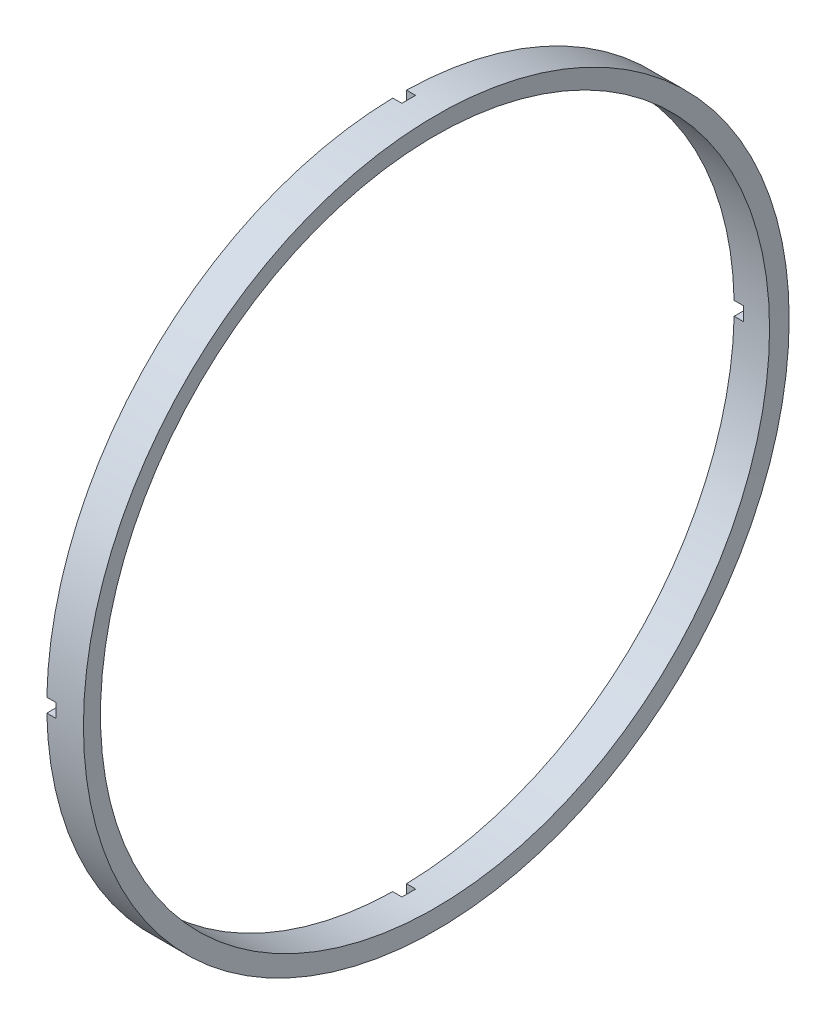
ISO-10303-21;
HEADER;
FILE_DESCRIPTION(('STEP AP214'),'2;1');
FILE_NAME('part.step','',(''),(''),'','','');
FILE_SCHEMA(('AUTOMOTIVE_DESIGN { 1 0 10303 214 1 1 1 1 }'));
ENDSEC;
DATA;
#1=APPLICATION_CONTEXT('core data for automotive mechanical design processes');
#2=APPLICATION_PROTOCOL_DEFINITION('international standard','automotive_design',2000,#1);
#3=PRODUCT_CONTEXT('',#1,'mechanical');
#4=PRODUCT('Part','Part','',(#3));
#5=PRODUCT_RELATED_PRODUCT_CATEGORY('part','',(#4));
#6=PRODUCT_DEFINITION_FORMATION('','',#4);
#7=PRODUCT_DEFINITION_CONTEXT('part definition',#1,'design');
#8=PRODUCT_DEFINITION('design','',#6,#7);
#9=PRODUCT_DEFINITION_SHAPE('','',#8);
#10=(LENGTH_UNIT() NAMED_UNIT(*) SI_UNIT(.MILLI.,.METRE.));
#11=(NAMED_UNIT(*) PLANE_ANGLE_UNIT() SI_UNIT($,.RADIAN.));
#12=(NAMED_UNIT(*) SI_UNIT($,.STERADIAN.) SOLID_ANGLE_UNIT());
#13=UNCERTAINTY_MEASURE_WITH_UNIT(LENGTH_MEASURE(1.E-05),#10,'distance_accuracy_value','');
#14=(GEOMETRIC_REPRESENTATION_CONTEXT(3) GLOBAL_UNCERTAINTY_ASSIGNED_CONTEXT((#13)) GLOBAL_UNIT_ASSIGNED_CONTEXT((#10,
#11,#12)) REPRESENTATION_CONTEXT('',''));
#15=CARTESIAN_POINT('',(0.,0.,0.));
#16=DIRECTION('',(0.,0.,1.));
#17=DIRECTION('',(1.,0.,0.));
#18=AXIS2_PLACEMENT_3D('',#15,#16,#17);
#19=CARTESIAN_POINT('',(0.,0.,0.));
#20=DIRECTION('',(1.00000000000002,0.,0.));
#21=DIRECTION('',(0.,0.,-1.));
#22=AXIS2_PLACEMENT_3D('',#19,#20,#21);
#23=CYLINDRICAL_SURFACE('',#22,38.5);
#24=CARTESIAN_POINT('',(-19.643965459528,0.,0.));
#25=DIRECTION('',(1.00000000000002,0.,0.));
#26=DIRECTION('',(0.,0.,-1.));
#27=AXIS2_PLACEMENT_3D('',#24,#25,#26);
#28=CIRCLE('',#27,38.5);
#29=CARTESIAN_POINT('',(-19.6439654595279,-1.75637288691068E-13,-38.5));
#30=VERTEX_POINT('',#29);
#31=EDGE_CURVE('E312',#30,#30,#28,.T.);
#32=ORIENTED_EDGE('',*,*,#31,.F.);
#33=EDGE_LOOP('',(#32));
#34=FACE_BOUND('',#33,.T.);
#35=CARTESIAN_POINT('',(-23.6439654595282,0.,0.));
#36=DIRECTION('',(1.00000000000002,0.,0.));
#37=DIRECTION('',(0.,0.,-1.));
#38=AXIS2_PLACEMENT_3D('',#35,#36,#37);
#39=CIRCLE('',#38,38.5);
#40=CARTESIAN_POINT('',(-23.6439654595281,0.750000000000042,-38.4926941120001));
#41=VERTEX_POINT('',#40);
#42=CARTESIAN_POINT('',(-23.64396545953,38.4926941120023,-0.750000000000536));
#43=VERTEX_POINT('',#42);
#44=EDGE_CURVE('E277',#41,#43,#39,.T.);
#45=ORIENTED_EDGE('',*,*,#44,.T.);
#46=DIRECTION('',(1.00000000000002,0.,0.));
#47=VECTOR('',#46,1.);
#48=CARTESIAN_POINT('',(2.22044604925031E-13,38.4926941120003,-0.750000000000002));
#49=LINE('',#48,#47);
#50=CARTESIAN_POINT('',(-22.6439654595296,38.4926941120014,-0.750000000000496));
#51=VERTEX_POINT('',#50);
#52=EDGE_CURVE('E321',#43,#51,#49,.T.);
#53=ORIENTED_EDGE('',*,*,#52,.T.);
#54=CARTESIAN_POINT('',(-22.6439654595281,0.,0.));
#55=DIRECTION('',(-1.00000000000002,0.,0.));
#56=DIRECTION('',(0.,0.,1.));
#57=AXIS2_PLACEMENT_3D('',#54,#55,#56);
#58=CIRCLE('',#57,38.5);
#59=CARTESIAN_POINT('',(-22.6439654595307,38.4926941120021,0.749999999999492));
#60=VERTEX_POINT('',#59);
#61=EDGE_CURVE('E326',#51,#60,#58,.F.);
#62=ORIENTED_EDGE('',*,*,#61,.T.);
#63=DIRECTION('',(1.00000000000002,0.,0.));
#64=VECTOR('',#63,1.);
#65=CARTESIAN_POINT('',(0.,38.492694112,0.750000000000013));
#66=LINE('',#65,#64);
#67=CARTESIAN_POINT('',(-23.6439654595306,38.4926941120019,0.749999999999202));
#68=VERTEX_POINT('',#67);
#69=EDGE_CURVE('E316',#68,#60,#66,.T.);
#70=ORIENTED_EDGE('',*,*,#69,.F.);
#71=CARTESIAN_POINT('',(-23.6439654595282,0.750000000000042,38.4926941119999));
#72=VERTEX_POINT('',#71);
#73=EDGE_CURVE('E286',#68,#72,#39,.T.);
#74=ORIENTED_EDGE('',*,*,#73,.T.);
#75=DIRECTION('',(1.00000000000002,0.,0.));
#76=VECTOR('',#75,1.);
#77=CARTESIAN_POINT('',(-1.11022302462516E-13,0.750000000000015,38.4926941119998));
#78=LINE('',#77,#76);
#79=CARTESIAN_POINT('',(-22.6439654595302,0.75000000000057,38.4926941119989));
#80=VERTEX_POINT('',#79);
#81=EDGE_CURVE('E280',#72,#80,#78,.T.);
#82=ORIENTED_EDGE('',*,*,#81,.T.);
#83=CARTESIAN_POINT('',(-22.6439654595296,-0.749999999999612,38.492694111999));
#84=VERTEX_POINT('',#83);
#85=EDGE_CURVE('E324',#80,#84,#58,.F.);
#86=ORIENTED_EDGE('',*,*,#85,.T.);
#87=DIRECTION('',(1.00000000000002,0.,0.));
#88=VECTOR('',#87,1.);
#89=CARTESIAN_POINT('',(1.11022302462516E-13,-0.749999999999973,38.4926941119999));
#90=LINE('',#89,#88);
#91=CARTESIAN_POINT('',(-23.6439654595279,-0.749999999999904,38.4926941119999));
#92=VERTEX_POINT('',#91);
#93=EDGE_CURVE('E333',#92,#84,#90,.T.);
#94=ORIENTED_EDGE('',*,*,#93,.F.);
#95=CARTESIAN_POINT('',(-23.6439654595279,-38.4926941120001,0.74999999999999));
#96=VERTEX_POINT('',#95);
#97=EDGE_CURVE('E292',#92,#96,#39,.T.);
#98=ORIENTED_EDGE('',*,*,#97,.T.);
#99=DIRECTION('',(1.00000000000002,0.,0.));
#100=VECTOR('',#99,1.);
#101=CARTESIAN_POINT('',(5.82867087928207E-13,-38.4926941120002,0.749999999999959));
#102=LINE('',#101,#100);
#103=CARTESIAN_POINT('',(-22.6439654595281,-38.4926941120001,0.749999999999977));
#104=VERTEX_POINT('',#103);
#105=EDGE_CURVE('E327',#104,#96,#102,.F.);
#106=ORIENTED_EDGE('',*,*,#105,.F.);
#107=CARTESIAN_POINT('',(-22.6439654595281,-38.492694112,-0.74999999999999));
#108=VERTEX_POINT('',#107);
#109=EDGE_CURVE('E323',#104,#108,#58,.F.);
#110=ORIENTED_EDGE('',*,*,#109,.T.);
#111=DIRECTION('',(1.00000000000002,0.,0.));
#112=VECTOR('',#111,1.);
#113=CARTESIAN_POINT('',(0.,-38.492694112,-0.750000000000001));
#114=LINE('',#113,#112);
#115=CARTESIAN_POINT('',(-23.6439654595282,-38.4926941120002,-0.750000000000434));
#116=VERTEX_POINT('',#115);
#117=EDGE_CURVE('E329',#108,#116,#114,.F.);
#118=ORIENTED_EDGE('',*,*,#117,.T.);
#119=CARTESIAN_POINT('',(-23.6439654595284,-0.749999999999695,-38.4926941120003));
#120=VERTEX_POINT('',#119);
#121=EDGE_CURVE('E288',#116,#120,#39,.T.);
#122=ORIENTED_EDGE('',*,*,#121,.T.);
#123=DIRECTION('',(1.00000000000002,0.,0.));
#124=VECTOR('',#123,1.);
#125=CARTESIAN_POINT('',(0.,-0.750000000000001,-38.4926941120001));
#126=LINE('',#125,#124);
#127=CARTESIAN_POINT('',(-22.6439654595284,-0.749999999999834,-38.4926941120002));
#128=VERTEX_POINT('',#127);
#129=EDGE_CURVE('E331',#128,#120,#126,.F.);
#130=ORIENTED_EDGE('',*,*,#129,.F.);
#131=CARTESIAN_POINT('',(-22.6439654595281,0.750000000000042,-38.492694112));
#132=VERTEX_POINT('',#131);
#133=EDGE_CURVE('E279',#128,#132,#58,.F.);
#134=ORIENTED_EDGE('',*,*,#133,.T.);
#135=DIRECTION('',(1.00000000000002,0.,0.));
#136=VECTOR('',#135,1.);
#137=CARTESIAN_POINT('',(0.,0.750000000000015,-38.4926941120001));
#138=LINE('',#137,#136);
#139=EDGE_CURVE('E264',#132,#41,#138,.F.);
#140=ORIENTED_EDGE('',*,*,#139,.T.);
#141=EDGE_LOOP('',(#45,#53,#62,#70,#74,#82,#86,#94,#98,#106,#110,#118,#122,#130,#134,#140));
#142=FACE_BOUND('',#141,.T.);
#143=ADVANCED_FACE('F149',(#34,#142),#23,.T.);
#144=CARTESIAN_POINT('',(-23.6439654595281,38.5000000000003,0.));
#145=DIRECTION('',(-1.00000000000002,0.,0.));
#146=DIRECTION('',(0.,0.,1.));
#147=AXIS2_PLACEMENT_3D('',#144,#145,#146);
#148=PLANE('',#147);
#149=CARTESIAN_POINT('',(-23.6439654595282,0.,0.));
#150=DIRECTION('',(1.00000000000002,0.,0.));
#151=DIRECTION('',(0.,0.,-1.));
#152=AXIS2_PLACEMENT_3D('',#149,#150,#151);
#153=CIRCLE('',#152,36.5);
#154=CARTESIAN_POINT('',(-23.6439654595283,0.750000000000098,-36.4922937070283));
#155=VERTEX_POINT('',#154);
#156=CARTESIAN_POINT('',(-23.6439654595298,36.4922937070311,-0.750000000000052));
#157=VERTEX_POINT('',#156);
#158=EDGE_CURVE('E295',#155,#157,#153,.T.);
#159=ORIENTED_EDGE('',*,*,#158,.T.);
#160=DIRECTION('',(0.,1.00000000000004,0.));
#161=VECTOR('',#160,1.);
#162=CARTESIAN_POINT('',(-23.6439654595282,0.,-0.750000000000066));
#163=LINE('',#162,#161);
#164=EDGE_CURVE('E285',#157,#43,#163,.T.);
#165=ORIENTED_EDGE('',*,*,#164,.T.);
#166=ORIENTED_EDGE('',*,*,#44,.F.);
#167=DIRECTION('',(0.,0.,1.));
#168=VECTOR('',#167,1.);
#169=CARTESIAN_POINT('',(-23.6439654595281,0.750000000000042,-38.5));
#170=LINE('',#169,#168);
#171=EDGE_CURVE('E261',#41,#155,#170,.T.);
#172=ORIENTED_EDGE('',*,*,#171,.T.);
#173=EDGE_LOOP('',(#159,#165,#166,#172));
#174=FACE_BOUND('',#173,.T.);
#175=ADVANCED_FACE('F284',(#174),#148,.T.);
#176=ORIENTED_EDGE('',*,*,#121,.F.);
#177=DIRECTION('',(0.,1.00000000000004,0.));
#178=VECTOR('',#177,1.);
#179=CARTESIAN_POINT('',(-23.6439654595278,-38.4999999999998,-0.750000000000025));
#180=LINE('',#179,#178);
#181=CARTESIAN_POINT('',(-23.6439654595282,-36.492293707028,-0.75000000000017));
#182=VERTEX_POINT('',#181);
#183=EDGE_CURVE('E345',#116,#182,#180,.T.);
#184=ORIENTED_EDGE('',*,*,#183,.T.);
#185=CARTESIAN_POINT('',(-23.6439654595281,-0.750000000000015,-36.4922937070282));
#186=VERTEX_POINT('',#185);
#187=EDGE_CURVE('E300',#182,#186,#153,.T.);
#188=ORIENTED_EDGE('',*,*,#187,.T.);
#189=DIRECTION('',(0.,0.,1.));
#190=VECTOR('',#189,1.);
#191=CARTESIAN_POINT('',(-23.6439654595282,-0.749999999999987,-38.5));
#192=LINE('',#191,#190);
#193=EDGE_CURVE('E272',#120,#186,#192,.T.);
#194=ORIENTED_EDGE('',*,*,#193,.F.);
#195=EDGE_LOOP('',(#176,#184,#188,#194));
#196=FACE_BOUND('',#195,.T.);
#197=ADVANCED_FACE('F407',(#196),#148,.T.);
#198=DIRECTION('',(0.,1.00000000000004,0.));
#199=VECTOR('',#198,1.);
#200=CARTESIAN_POINT('',(-23.6439654595286,1.66533453693773E-13,0.749999999999796));
#201=LINE('',#200,#199);
#202=CARTESIAN_POINT('',(-23.6439654595307,36.4922937070299,0.74999999999938));
#203=VERTEX_POINT('',#202);
#204=EDGE_CURVE('E363',#203,#68,#201,.T.);
#205=ORIENTED_EDGE('',*,*,#204,.F.);
#206=CARTESIAN_POINT('',(-23.6439654595283,0.750000000000042,36.4922937070278));
#207=VERTEX_POINT('',#206);
#208=EDGE_CURVE('E299',#203,#207,#153,.T.);
#209=ORIENTED_EDGE('',*,*,#208,.T.);
#210=DIRECTION('',(0.,0.,1.));
#211=VECTOR('',#210,1.);
#212=CARTESIAN_POINT('',(-23.6439654595282,0.750000000000098,-1.74861099546289E-13));
#213=LINE('',#212,#211);
#214=EDGE_CURVE('E350',#207,#72,#213,.T.);
#215=ORIENTED_EDGE('',*,*,#214,.T.);
#216=ORIENTED_EDGE('',*,*,#73,.F.);
#217=EDGE_LOOP('',(#205,#209,#215,#216));
#218=FACE_BOUND('',#217,.T.);
#219=ADVANCED_FACE('F435',(#218),#148,.T.);
#220=DIRECTION('',(0.,1.00000000000004,0.));
#221=VECTOR('',#220,1.);
#222=CARTESIAN_POINT('',(-23.6439654595276,-38.5000000000001,0.750000000000011));
#223=LINE('',#222,#221);
#224=CARTESIAN_POINT('',(-23.643965459528,-36.4922937070283,0.7499999999999));
#225=VERTEX_POINT('',#224);
#226=EDGE_CURVE('E343',#96,#225,#223,.T.);
#227=ORIENTED_EDGE('',*,*,#226,.F.);
#228=ORIENTED_EDGE('',*,*,#97,.F.);
#229=DIRECTION('',(0.,0.,1.));
#230=VECTOR('',#229,1.);
#231=CARTESIAN_POINT('',(-23.6439654595281,-0.749999999999931,0.));
#232=LINE('',#231,#230);
#233=CARTESIAN_POINT('',(-23.6439654595289,-0.749999999999931,36.4922937070275));
#234=VERTEX_POINT('',#233);
#235=EDGE_CURVE('E353',#234,#92,#232,.T.);
#236=ORIENTED_EDGE('',*,*,#235,.F.);
#237=EDGE_CURVE('E302',#234,#225,#153,.T.);
#238=ORIENTED_EDGE('',*,*,#237,.T.);
#239=EDGE_LOOP('',(#227,#228,#236,#238));
#240=FACE_BOUND('',#239,.T.);
#241=ADVANCED_FACE('F423',(#240),#148,.T.);
#242=CARTESIAN_POINT('',(0.,0.,0.));
#243=DIRECTION('',(1.00000000000002,0.,0.));
#244=DIRECTION('',(0.,0.,-1.));
#245=AXIS2_PLACEMENT_3D('',#242,#243,#244);
#246=CYLINDRICAL_SURFACE('',#245,36.5);
#247=DIRECTION('',(1.00000000000002,0.,0.));
#248=VECTOR('',#247,1.);
#249=CARTESIAN_POINT('',(-2.77555756156289E-13,36.4922937070282,0.749999999999904));
#250=LINE('',#249,#248);
#251=CARTESIAN_POINT('',(-22.6439654595301,36.4922937070298,0.749999999999465));
#252=VERTEX_POINT('',#251);
#253=EDGE_CURVE('E14',#252,#203,#250,.F.);
#254=ORIENTED_EDGE('',*,*,#253,.F.);
#255=CARTESIAN_POINT('',(-22.6439654595281,0.,0.));
#256=DIRECTION('',(-1.00000000000002,0.,0.));
#257=DIRECTION('',(0.,0.,1.));
#258=AXIS2_PLACEMENT_3D('',#255,#256,#257);
#259=CIRCLE('',#258,36.5);
#260=CARTESIAN_POINT('',(-22.6439654595303,36.4922937070301,-0.750000000000647));
#261=VERTEX_POINT('',#260);
#262=EDGE_CURVE('E380',#252,#261,#259,.T.);
#263=ORIENTED_EDGE('',*,*,#262,.T.);
#264=DIRECTION('',(1.00000000000002,0.,0.));
#265=VECTOR('',#264,1.);
#266=CARTESIAN_POINT('',(-2.22044604925031E-13,36.4922937070283,-0.750000000000098));
#267=LINE('',#266,#265);
#268=EDGE_CURVE('E156',#261,#157,#267,.F.);
#269=ORIENTED_EDGE('',*,*,#268,.T.);
#270=ORIENTED_EDGE('',*,*,#158,.F.);
#271=DIRECTION('',(1.00000000000002,0.,0.));
#272=VECTOR('',#271,1.);
#273=CARTESIAN_POINT('',(0.,0.750000000000015,-36.4922937070282));
#274=LINE('',#273,#272);
#275=CARTESIAN_POINT('',(-22.643965459529,0.750000000000334,-36.4922937070285));
#276=VERTEX_POINT('',#275);
#277=EDGE_CURVE('E267',#155,#276,#274,.T.);
#278=ORIENTED_EDGE('',*,*,#277,.T.);
#279=CARTESIAN_POINT('',(-22.6439654595281,-0.750000000000001,-36.4922937070282));
#280=VERTEX_POINT('',#279);
#281=EDGE_CURVE('E289',#276,#280,#259,.T.);
#282=ORIENTED_EDGE('',*,*,#281,.T.);
#283=DIRECTION('',(1.00000000000002,0.,0.));
#284=VECTOR('',#283,1.);
#285=CARTESIAN_POINT('',(0.,-0.750000000000015,-36.4922937070282));
#286=LINE('',#285,#284);
#287=EDGE_CURVE('E391',#186,#280,#286,.T.);
#288=ORIENTED_EDGE('',*,*,#287,.F.);
#289=ORIENTED_EDGE('',*,*,#187,.F.);
#290=DIRECTION('',(1.00000000000002,0.,0.));
#291=VECTOR('',#290,1.);
#292=CARTESIAN_POINT('',(0.,-36.4922937070281,-0.750000000000056));
#293=LINE('',#292,#291);
#294=CARTESIAN_POINT('',(-22.643965459528,-36.4922937070279,-0.749999999999995));
#295=VERTEX_POINT('',#294);
#296=EDGE_CURVE('E388',#182,#295,#293,.T.);
#297=ORIENTED_EDGE('',*,*,#296,.T.);
#298=CARTESIAN_POINT('',(-22.6439654595281,-36.4922937070281,0.749999999999985));
#299=VERTEX_POINT('',#298);
#300=EDGE_CURVE('E384',#295,#299,#259,.T.);
#301=ORIENTED_EDGE('',*,*,#300,.T.);
#302=DIRECTION('',(1.00000000000002,0.,0.));
#303=VECTOR('',#302,1.);
#304=CARTESIAN_POINT('',(0.,-36.4922937070281,0.749999999999959));
#305=LINE('',#304,#303);
#306=EDGE_CURVE('E382',#225,#299,#305,.T.);
#307=ORIENTED_EDGE('',*,*,#306,.F.);
#308=ORIENTED_EDGE('',*,*,#237,.F.);
#309=DIRECTION('',(1.00000000000002,0.,0.));
#310=VECTOR('',#309,1.);
#311=CARTESIAN_POINT('',(0.,-0.74999999999989,36.4922937070278));
#312=LINE('',#311,#310);
#313=CARTESIAN_POINT('',(-22.6439654595283,-0.749999999999834,36.4922937070277));
#314=VERTEX_POINT('',#313);
#315=EDGE_CURVE('E396',#314,#234,#312,.F.);
#316=ORIENTED_EDGE('',*,*,#315,.F.);
#317=CARTESIAN_POINT('',(-22.6439654595286,0.750000000000195,36.4922937070277));
#318=VERTEX_POINT('',#317);
#319=EDGE_CURVE('E389',#314,#318,#259,.T.);
#320=ORIENTED_EDGE('',*,*,#319,.T.);
#321=DIRECTION('',(1.00000000000002,0.,0.));
#322=VECTOR('',#321,1.);
#323=CARTESIAN_POINT('',(-1.11022302462516E-13,0.750000000000209,36.4922937070277));
#324=LINE('',#323,#322);
#325=EDGE_CURVE('E394',#318,#207,#324,.F.);
#326=ORIENTED_EDGE('',*,*,#325,.T.);
#327=ORIENTED_EDGE('',*,*,#208,.F.);
#328=EDGE_LOOP('',(#254,#263,#269,#270,#278,#282,#288,#289,#297,#301,#307,#308,#316,#320,#326,#327));
#329=FACE_BOUND('',#328,.T.);
#330=CARTESIAN_POINT('',(-19.7838190834151,0.,0.));
#331=DIRECTION('',(1.00000000000002,0.,0.));
#332=DIRECTION('',(0.,0.,-1.));
#333=AXIS2_PLACEMENT_3D('',#330,#331,#332);
#334=CIRCLE('',#333,36.5);
#335=CARTESIAN_POINT('',(-19.7838190834149,-1.64350501568237E-13,-36.5));
#336=VERTEX_POINT('',#335);
#337=EDGE_CURVE('E305',#336,#336,#334,.T.);
#338=ORIENTED_EDGE('',*,*,#337,.T.);
#339=EDGE_LOOP('',(#338));
#340=FACE_BOUND('',#339,.T.);
#341=ADVANCED_FACE('F404',(#329,#340),#246,.F.);
#342=CARTESIAN_POINT('',(-19.7838190834151,0.,0.));
#343=DIRECTION('',(1.00000000000002,0.,0.));
#344=DIRECTION('',(0.,0.,-1.));
#345=AXIS2_PLACEMENT_3D('',#342,#343,#344);
#346=CONICAL_SURFACE('',#345,36.5,1.50098315671512);
#347=ORIENTED_EDGE('',*,*,#31,.T.);
#348=EDGE_LOOP('',(#347));
#349=FACE_BOUND('',#348,.T.);
#350=ORIENTED_EDGE('',*,*,#337,.F.);
#351=EDGE_LOOP('',(#350));
#352=FACE_BOUND('',#351,.T.);
#353=ADVANCED_FACE('F449',(#349,#352),#346,.F.);
#354=CARTESIAN_POINT('',(-22.6439654595281,0.750000000000334,-38.5));
#355=DIRECTION('',(0.,-1.00000000000004,0.));
#356=DIRECTION('',(0.,0.,-1.));
#357=AXIS2_PLACEMENT_3D('',#354,#355,#356);
#358=PLANE('',#357);
#359=DIRECTION('',(0.,0.,1.));
#360=VECTOR('',#359,1.);
#361=CARTESIAN_POINT('',(-22.6439654595281,0.750000000000334,-38.5));
#362=LINE('',#361,#360);
#363=EDGE_CURVE('E338',#132,#276,#362,.T.);
#364=ORIENTED_EDGE('',*,*,#363,.T.);
#365=ORIENTED_EDGE('',*,*,#277,.F.);
#366=ORIENTED_EDGE('',*,*,#171,.F.);
#367=ORIENTED_EDGE('',*,*,#139,.F.);
#368=EDGE_LOOP('',(#364,#365,#366,#367));
#369=FACE_BOUND('',#368,.T.);
#370=ADVANCED_FACE('F263',(#369),#358,.T.);
#371=CARTESIAN_POINT('',(-22.6439654595284,-0.749999999999834,-38.5000000000002));
#372=DIRECTION('',(0.,-1.00000000000004,0.));
#373=DIRECTION('',(0.,0.,-1.));
#374=AXIS2_PLACEMENT_3D('',#371,#372,#373);
#375=PLANE('',#374);
#376=ORIENTED_EDGE('',*,*,#129,.T.);
#377=ORIENTED_EDGE('',*,*,#193,.T.);
#378=ORIENTED_EDGE('',*,*,#287,.T.);
#379=DIRECTION('',(0.,0.,1.));
#380=VECTOR('',#379,1.);
#381=CARTESIAN_POINT('',(-22.6439654595284,-0.749999999999834,-38.5000000000002));
#382=LINE('',#381,#380);
#383=EDGE_CURVE('E340',#128,#280,#382,.T.);
#384=ORIENTED_EDGE('',*,*,#383,.F.);
#385=EDGE_LOOP('',(#376,#377,#378,#384));
#386=FACE_BOUND('',#385,.T.);
#387=ADVANCED_FACE('F409',(#386),#375,.F.);
#388=CARTESIAN_POINT('',(-22.6439654595281,0.,0.));
#389=DIRECTION('',(-1.00000000000002,0.,0.));
#390=DIRECTION('',(0.,0.,1.));
#391=AXIS2_PLACEMENT_3D('',#388,#389,#390);
#392=PLANE('',#391);
#393=ORIENTED_EDGE('',*,*,#383,.T.);
#394=ORIENTED_EDGE('',*,*,#281,.F.);
#395=ORIENTED_EDGE('',*,*,#363,.F.);
#396=ORIENTED_EDGE('',*,*,#133,.F.);
#397=EDGE_LOOP('',(#393,#394,#395,#396));
#398=FACE_BOUND('',#397,.T.);
#399=ADVANCED_FACE('F412',(#398),#392,.T.);
#400=CARTESIAN_POINT('',(-22.6439654595282,0.750000000000028,0.));
#401=DIRECTION('',(0.,-1.00000000000004,0.));
#402=DIRECTION('',(0.,0.,-1.));
#403=AXIS2_PLACEMENT_3D('',#400,#401,#402);
#404=PLANE('',#403);
#405=ORIENTED_EDGE('',*,*,#214,.F.);
#406=ORIENTED_EDGE('',*,*,#325,.F.);
#407=DIRECTION('',(0.,0.,1.));
#408=VECTOR('',#407,1.);
#409=CARTESIAN_POINT('',(-22.6439654595282,0.750000000000028,0.));
#410=LINE('',#409,#408);
#411=EDGE_CURVE('E355',#318,#80,#410,.T.);
#412=ORIENTED_EDGE('',*,*,#411,.T.);
#413=ORIENTED_EDGE('',*,*,#81,.F.);
#414=EDGE_LOOP('',(#405,#406,#412,#413));
#415=FACE_BOUND('',#414,.T.);
#416=ADVANCED_FACE('F433',(#415),#404,.T.);
#417=CARTESIAN_POINT('',(-22.6439654595282,-0.749999999999959,-1.61213318382958E-13));
#418=DIRECTION('',(0.,-1.00000000000004,0.));
#419=DIRECTION('',(0.,0.,-1.));
#420=AXIS2_PLACEMENT_3D('',#417,#418,#419);
#421=PLANE('',#420);
#422=ORIENTED_EDGE('',*,*,#93,.T.);
#423=DIRECTION('',(0.,0.,1.));
#424=VECTOR('',#423,1.);
#425=CARTESIAN_POINT('',(-22.6439654595282,-0.749999999999959,-1.61213318382958E-13));
#426=LINE('',#425,#424);
#427=EDGE_CURVE('E358',#314,#84,#426,.T.);
#428=ORIENTED_EDGE('',*,*,#427,.F.);
#429=ORIENTED_EDGE('',*,*,#315,.T.);
#430=ORIENTED_EDGE('',*,*,#235,.T.);
#431=EDGE_LOOP('',(#422,#428,#429,#430));
#432=FACE_BOUND('',#431,.T.);
#433=ADVANCED_FACE('F427',(#432),#421,.F.);
#434=ORIENTED_EDGE('',*,*,#85,.F.);
#435=ORIENTED_EDGE('',*,*,#411,.F.);
#436=ORIENTED_EDGE('',*,*,#319,.F.);
#437=ORIENTED_EDGE('',*,*,#427,.T.);
#438=EDGE_LOOP('',(#434,#435,#436,#437));
#439=FACE_BOUND('',#438,.T.);
#440=ADVANCED_FACE('F431',(#439),#392,.T.);
#441=CARTESIAN_POINT('',(-22.6439654595277,-38.4999999999998,-0.750000000000016));
#442=DIRECTION('',(0.,0.,1.));
#443=DIRECTION('',(1.00000000000002,0.,0.));
#444=AXIS2_PLACEMENT_3D('',#441,#442,#443);
#445=PLANE('',#444);
#446=DIRECTION('',(0.,1.00000000000004,0.));
#447=VECTOR('',#446,1.);
#448=CARTESIAN_POINT('',(-22.6439654595277,-38.4999999999998,-0.750000000000016));
#449=LINE('',#448,#447);
#450=EDGE_CURVE('E171',#108,#295,#449,.T.);
#451=ORIENTED_EDGE('',*,*,#450,.T.);
#452=ORIENTED_EDGE('',*,*,#296,.F.);
#453=ORIENTED_EDGE('',*,*,#183,.F.);
#454=ORIENTED_EDGE('',*,*,#117,.F.);
#455=EDGE_LOOP('',(#451,#452,#453,#454));
#456=FACE_BOUND('',#455,.T.);
#457=ADVANCED_FACE('F406',(#456),#445,.T.);
#458=CARTESIAN_POINT('',(-22.6439654595277,-38.5000000000001,0.749999999999985));
#459=DIRECTION('',(0.,0.,1.));
#460=DIRECTION('',(1.00000000000002,0.,0.));
#461=AXIS2_PLACEMENT_3D('',#458,#459,#460);
#462=PLANE('',#461);
#463=ORIENTED_EDGE('',*,*,#105,.T.);
#464=ORIENTED_EDGE('',*,*,#226,.T.);
#465=ORIENTED_EDGE('',*,*,#306,.T.);
#466=DIRECTION('',(0.,1.00000000000004,0.));
#467=VECTOR('',#466,1.);
#468=CARTESIAN_POINT('',(-22.6439654595277,-38.5000000000001,0.749999999999985));
#469=LINE('',#468,#467);
#470=EDGE_CURVE('E347',#104,#299,#469,.T.);
#471=ORIENTED_EDGE('',*,*,#470,.F.);
#472=EDGE_LOOP('',(#463,#464,#465,#471));
#473=FACE_BOUND('',#472,.T.);
#474=ADVANCED_FACE('F418',(#473),#462,.F.);
#475=ORIENTED_EDGE('',*,*,#470,.T.);
#476=ORIENTED_EDGE('',*,*,#300,.F.);
#477=ORIENTED_EDGE('',*,*,#450,.F.);
#478=ORIENTED_EDGE('',*,*,#109,.F.);
#479=EDGE_LOOP('',(#475,#476,#477,#478));
#480=FACE_BOUND('',#479,.T.);
#481=ADVANCED_FACE('F416',(#480),#392,.T.);
#482=DIRECTION('',(0.,1.00000000000004,0.));
#483=VECTOR('',#482,1.);
#484=CARTESIAN_POINT('',(-22.6439654595282,0.,-0.750000000000064));
#485=LINE('',#484,#483);
#486=EDGE_CURVE('E163',#261,#51,#485,.T.);
#487=ORIENTED_EDGE('',*,*,#486,.F.);
#488=ORIENTED_EDGE('',*,*,#262,.F.);
#489=DIRECTION('',(0.,1.00000000000004,0.));
#490=VECTOR('',#489,1.);
#491=CARTESIAN_POINT('',(-22.6439654595284,1.11022302462516E-13,0.74999999999977));
#492=LINE('',#491,#490);
#493=EDGE_CURVE('E281',#252,#60,#492,.T.);
#494=ORIENTED_EDGE('',*,*,#493,.T.);
#495=ORIENTED_EDGE('',*,*,#61,.F.);
#496=EDGE_LOOP('',(#487,#488,#494,#495));
#497=FACE_BOUND('',#496,.T.);
#498=ADVANCED_FACE('F379',(#497),#392,.T.);
#499=CARTESIAN_POINT('',(-22.6439654595284,1.11022302462516E-13,0.74999999999977));
#500=DIRECTION('',(0.,0.,1.));
#501=DIRECTION('',(1.00000000000002,0.,0.));
#502=AXIS2_PLACEMENT_3D('',#499,#500,#501);
#503=PLANE('',#502);
#504=ORIENTED_EDGE('',*,*,#69,.T.);
#505=ORIENTED_EDGE('',*,*,#493,.F.);
#506=ORIENTED_EDGE('',*,*,#253,.T.);
#507=ORIENTED_EDGE('',*,*,#204,.T.);
#508=EDGE_LOOP('',(#504,#505,#506,#507));
#509=FACE_BOUND('',#508,.T.);
#510=ADVANCED_FACE('F376',(#509),#503,.F.);
#511=CARTESIAN_POINT('',(-22.6439654595282,0.,-0.750000000000064));
#512=DIRECTION('',(0.,0.,1.));
#513=DIRECTION('',(1.00000000000002,0.,0.));
#514=AXIS2_PLACEMENT_3D('',#511,#512,#513);
#515=PLANE('',#514);
#516=ORIENTED_EDGE('',*,*,#164,.F.);
#517=ORIENTED_EDGE('',*,*,#268,.F.);
#518=ORIENTED_EDGE('',*,*,#486,.T.);
#519=ORIENTED_EDGE('',*,*,#52,.F.);
#520=EDGE_LOOP('',(#516,#517,#518,#519));
#521=FACE_BOUND('',#520,.T.);
#522=ADVANCED_FACE('F369',(#521),#515,.T.);
#523=CLOSED_SHELL('',(#143,#175,#197,#219,#241,#341,#353,#370,#387,#399,#416,#433,#440,#457,
#474,#481,#498,#510,#522));
#524=MANIFOLD_SOLID_BREP('B2',#523);
#525=ADVANCED_BREP_SHAPE_REPRESENTATION('',(#18,#524),#14);
#526=SHAPE_DEFINITION_REPRESENTATION(#9,#525);
ENDSEC;
END-ISO-10303-21;
